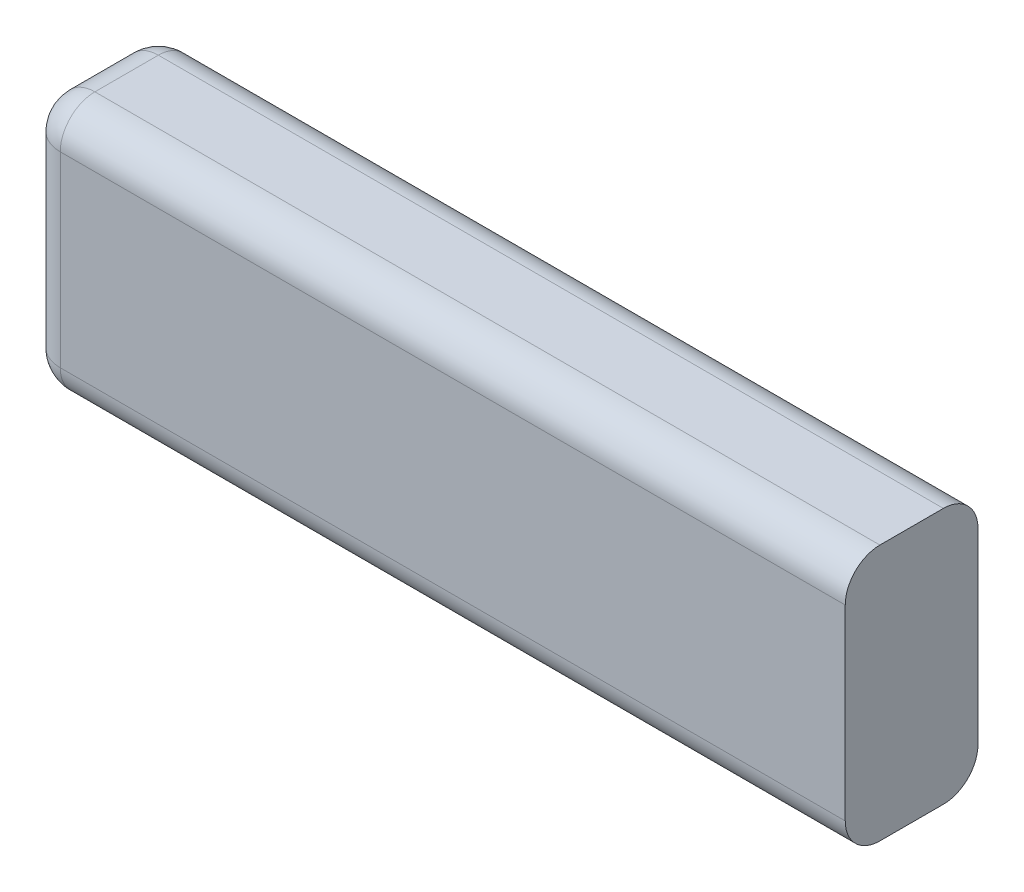
ISO-10303-21;
HEADER;
FILE_DESCRIPTION(('STEP AP214'),'2;1');
FILE_NAME('part.step','',(''),(''),'','','');
FILE_SCHEMA(('AUTOMOTIVE_DESIGN { 1 0 10303 214 1 1 1 1 }'));
ENDSEC;
DATA;
#1=APPLICATION_CONTEXT('core data for automotive mechanical design processes');
#2=APPLICATION_PROTOCOL_DEFINITION('international standard','automotive_design',2000,#1);
#3=PRODUCT_CONTEXT('',#1,'mechanical');
#4=PRODUCT('Part','Part','',(#3));
#5=PRODUCT_RELATED_PRODUCT_CATEGORY('part','',(#4));
#6=PRODUCT_DEFINITION_FORMATION('','',#4);
#7=PRODUCT_DEFINITION_CONTEXT('part definition',#1,'design');
#8=PRODUCT_DEFINITION('design','',#6,#7);
#9=PRODUCT_DEFINITION_SHAPE('','',#8);
#10=(LENGTH_UNIT() NAMED_UNIT(*) SI_UNIT(.MILLI.,.METRE.));
#11=(NAMED_UNIT(*) PLANE_ANGLE_UNIT() SI_UNIT($,.RADIAN.));
#12=(NAMED_UNIT(*) SI_UNIT($,.STERADIAN.) SOLID_ANGLE_UNIT());
#13=UNCERTAINTY_MEASURE_WITH_UNIT(LENGTH_MEASURE(1.E-05),#10,'distance_accuracy_value','');
#14=(GEOMETRIC_REPRESENTATION_CONTEXT(3) GLOBAL_UNCERTAINTY_ASSIGNED_CONTEXT((#13)) GLOBAL_UNIT_ASSIGNED_CONTEXT((#10,
#11,#12)) REPRESENTATION_CONTEXT('',''));
#15=CARTESIAN_POINT('',(0.,0.,0.));
#16=DIRECTION('',(0.,0.,1.));
#17=DIRECTION('',(1.,0.,0.));
#18=AXIS2_PLACEMENT_3D('',#15,#16,#17);
#19=CARTESIAN_POINT('',(0.,0.,5.75));
#20=DIRECTION('',(1.,0.,0.));
#21=DIRECTION('',(0.,0.,-1.));
#22=AXIS2_PLACEMENT_3D('',#19,#20,#21);
#23=PLANE('',#22);
#24=DIRECTION('',(0.,-1.,0.));
#25=VECTOR('',#24,1.);
#26=CARTESIAN_POINT('',(0.,0.,1.5));
#27=LINE('',#26,#25);
#28=CARTESIAN_POINT('',(0.,9.6,1.5));
#29=VERTEX_POINT('',#28);
#30=CARTESIAN_POINT('',(0.,1.5,1.5));
#31=VERTEX_POINT('',#30);
#32=EDGE_CURVE('E159',#29,#31,#27,.T.);
#33=ORIENTED_EDGE('',*,*,#32,.T.);
#34=DIRECTION('',(0.,0.,-1.));
#35=VECTOR('',#34,1.);
#36=CARTESIAN_POINT('',(0.,1.5,5.75));
#37=LINE('',#36,#35);
#38=CARTESIAN_POINT('',(0.,1.5,4.25));
#39=VERTEX_POINT('',#38);
#40=EDGE_CURVE('E161',#31,#39,#37,.F.);
#41=ORIENTED_EDGE('',*,*,#40,.T.);
#42=DIRECTION('',(0.,-1.,0.));
#43=VECTOR('',#42,1.);
#44=CARTESIAN_POINT('',(0.,0.,4.25));
#45=LINE('',#44,#43);
#46=CARTESIAN_POINT('',(0.,9.6,4.25));
#47=VERTEX_POINT('',#46);
#48=EDGE_CURVE('E157',#39,#47,#45,.F.);
#49=ORIENTED_EDGE('',*,*,#48,.T.);
#50=DIRECTION('',(0.,0.,-1.));
#51=VECTOR('',#50,1.);
#52=CARTESIAN_POINT('',(0.,9.6,5.75));
#53=LINE('',#52,#51);
#54=EDGE_CURVE('E155',#47,#29,#53,.T.);
#55=ORIENTED_EDGE('',*,*,#54,.T.);
#56=EDGE_LOOP('',(#33,#41,#49,#55));
#57=FACE_BOUND('',#56,.T.);
#58=ADVANCED_FACE('F32',(#57),#23,.F.);
#59=CARTESIAN_POINT('',(0.,0.,5.75));
#60=DIRECTION('',(0.,1.,0.));
#61=DIRECTION('',(0.,0.,1.));
#62=AXIS2_PLACEMENT_3D('',#59,#60,#61);
#63=PLANE('',#62);
#64=DIRECTION('',(0.,0.,-1.));
#65=VECTOR('',#64,1.);
#66=CARTESIAN_POINT('',(1.5,0.,5.75));
#67=LINE('',#66,#65);
#68=CARTESIAN_POINT('',(1.5,0.,4.25));
#69=VERTEX_POINT('',#68);
#70=CARTESIAN_POINT('',(1.5,0.,1.5));
#71=VERTEX_POINT('',#70);
#72=EDGE_CURVE('E128',#69,#71,#67,.T.);
#73=ORIENTED_EDGE('',*,*,#72,.T.);
#74=DIRECTION('',(1.,0.,0.));
#75=VECTOR('',#74,1.);
#76=CARTESIAN_POINT('',(35.5,0.,1.5));
#77=LINE('',#76,#75);
#78=CARTESIAN_POINT('',(35.5,0.,1.5));
#79=VERTEX_POINT('',#78);
#80=EDGE_CURVE('E127',#71,#79,#77,.T.);
#81=ORIENTED_EDGE('',*,*,#80,.T.);
#82=DIRECTION('',(0.,0.,-1.));
#83=VECTOR('',#82,1.);
#84=CARTESIAN_POINT('',(35.5,0.,5.75));
#85=LINE('',#84,#83);
#86=CARTESIAN_POINT('',(35.5,0.,4.25));
#87=VERTEX_POINT('',#86);
#88=EDGE_CURVE('E112',#87,#79,#85,.T.);
#89=ORIENTED_EDGE('',*,*,#88,.F.);
#90=DIRECTION('',(1.,0.,0.));
#91=VECTOR('',#90,1.);
#92=CARTESIAN_POINT('',(0.,0.,4.25));
#93=LINE('',#92,#91);
#94=EDGE_CURVE('E124',#87,#69,#93,.F.);
#95=ORIENTED_EDGE('',*,*,#94,.T.);
#96=EDGE_LOOP('',(#73,#81,#89,#95));
#97=FACE_BOUND('',#96,.T.);
#98=ADVANCED_FACE('F123',(#97),#63,.F.);
#99=CARTESIAN_POINT('',(35.5,0.,5.75));
#100=DIRECTION('',(-1.,0.,0.));
#101=DIRECTION('',(0.,0.,1.));
#102=AXIS2_PLACEMENT_3D('',#99,#100,#101);
#103=PLANE('',#102);
#104=ORIENTED_EDGE('',*,*,#88,.T.);
#105=CARTESIAN_POINT('',(35.5,1.5,1.5));
#106=DIRECTION('',(-1.,0.,0.));
#107=DIRECTION('',(0.,0.,1.));
#108=AXIS2_PLACEMENT_3D('',#105,#106,#107);
#109=CIRCLE('',#108,1.5);
#110=CARTESIAN_POINT('',(35.5,1.5,0.));
#111=VERTEX_POINT('',#110);
#112=EDGE_CURVE('E118',#79,#111,#109,.F.);
#113=ORIENTED_EDGE('',*,*,#112,.T.);
#114=DIRECTION('',(0.,1.,0.));
#115=VECTOR('',#114,1.);
#116=CARTESIAN_POINT('',(35.5,0.,0.));
#117=LINE('',#116,#115);
#118=CARTESIAN_POINT('',(35.5,9.6,0.));
#119=VERTEX_POINT('',#118);
#120=EDGE_CURVE('E198',#111,#119,#117,.T.);
#121=ORIENTED_EDGE('',*,*,#120,.T.);
#122=CARTESIAN_POINT('',(35.5,9.6,1.5));
#123=DIRECTION('',(-1.,0.,0.));
#124=DIRECTION('',(0.,0.,1.));
#125=AXIS2_PLACEMENT_3D('',#122,#123,#124);
#126=CIRCLE('',#125,1.5);
#127=CARTESIAN_POINT('',(35.5,11.1,1.5));
#128=VERTEX_POINT('',#127);
#129=EDGE_CURVE('E119',#119,#128,#126,.F.);
#130=ORIENTED_EDGE('',*,*,#129,.T.);
#131=DIRECTION('',(0.,0.,-1.));
#132=VECTOR('',#131,1.);
#133=CARTESIAN_POINT('',(35.5,11.1,5.75));
#134=LINE('',#133,#132);
#135=CARTESIAN_POINT('',(35.5,11.1,4.25));
#136=VERTEX_POINT('',#135);
#137=EDGE_CURVE('E129',#136,#128,#134,.T.);
#138=ORIENTED_EDGE('',*,*,#137,.F.);
#139=CARTESIAN_POINT('',(35.5,9.6,4.25));
#140=DIRECTION('',(-1.,0.,0.));
#141=DIRECTION('',(0.,0.,1.));
#142=AXIS2_PLACEMENT_3D('',#139,#140,#141);
#143=CIRCLE('',#142,1.5);
#144=CARTESIAN_POINT('',(35.5,9.6,5.75));
#145=VERTEX_POINT('',#144);
#146=EDGE_CURVE('E136',#136,#145,#143,.F.);
#147=ORIENTED_EDGE('',*,*,#146,.T.);
#148=DIRECTION('',(0.,1.,0.));
#149=VECTOR('',#148,1.);
#150=CARTESIAN_POINT('',(35.5,0.,5.75));
#151=LINE('',#150,#149);
#152=CARTESIAN_POINT('',(35.5,1.5,5.75));
#153=VERTEX_POINT('',#152);
#154=EDGE_CURVE('E114',#153,#145,#151,.T.);
#155=ORIENTED_EDGE('',*,*,#154,.F.);
#156=CARTESIAN_POINT('',(35.5,1.5,4.25));
#157=DIRECTION('',(-1.,0.,0.));
#158=DIRECTION('',(0.,0.,1.));
#159=AXIS2_PLACEMENT_3D('',#156,#157,#158);
#160=CIRCLE('',#159,1.5);
#161=EDGE_CURVE('E109',#153,#87,#160,.F.);
#162=ORIENTED_EDGE('',*,*,#161,.T.);
#163=EDGE_LOOP('',(#104,#113,#121,#130,#138,#147,#155,#162));
#164=FACE_BOUND('',#163,.T.);
#165=ADVANCED_FACE('F111',(#164),#103,.F.);
#166=CARTESIAN_POINT('',(0.,11.1,5.75));
#167=DIRECTION('',(0.,-1.,0.));
#168=DIRECTION('',(0.,0.,-1.));
#169=AXIS2_PLACEMENT_3D('',#166,#167,#168);
#170=PLANE('',#169);
#171=ORIENTED_EDGE('',*,*,#137,.T.);
#172=DIRECTION('',(-1.,0.,0.));
#173=VECTOR('',#172,1.);
#174=CARTESIAN_POINT('',(0.,11.1,1.5));
#175=LINE('',#174,#173);
#176=CARTESIAN_POINT('',(1.5,11.1,1.5));
#177=VERTEX_POINT('',#176);
#178=EDGE_CURVE('E11',#128,#177,#175,.T.);
#179=ORIENTED_EDGE('',*,*,#178,.T.);
#180=DIRECTION('',(0.,0.,-1.));
#181=VECTOR('',#180,1.);
#182=CARTESIAN_POINT('',(1.5,11.1,5.75));
#183=LINE('',#182,#181);
#184=CARTESIAN_POINT('',(1.5,11.1,4.25));
#185=VERTEX_POINT('',#184);
#186=EDGE_CURVE('E48',#177,#185,#183,.F.);
#187=ORIENTED_EDGE('',*,*,#186,.T.);
#188=DIRECTION('',(-1.,0.,0.));
#189=VECTOR('',#188,1.);
#190=CARTESIAN_POINT('',(0.,11.1,4.25));
#191=LINE('',#190,#189);
#192=EDGE_CURVE('E41',#185,#136,#191,.F.);
#193=ORIENTED_EDGE('',*,*,#192,.T.);
#194=EDGE_LOOP('',(#171,#179,#187,#193));
#195=FACE_BOUND('',#194,.T.);
#196=ADVANCED_FACE('F209',(#195),#170,.F.);
#197=CARTESIAN_POINT('',(0.,0.,5.75));
#198=DIRECTION('',(0.,0.,-1.));
#199=DIRECTION('',(-1.,0.,0.));
#200=AXIS2_PLACEMENT_3D('',#197,#198,#199);
#201=PLANE('',#200);
#202=DIRECTION('',(0.,-1.,0.));
#203=VECTOR('',#202,1.);
#204=CARTESIAN_POINT('',(1.5,0.,5.75));
#205=LINE('',#204,#203);
#206=CARTESIAN_POINT('',(1.5,9.6,5.75));
#207=VERTEX_POINT('',#206);
#208=CARTESIAN_POINT('',(1.5,1.5,5.75));
#209=VERTEX_POINT('',#208);
#210=EDGE_CURVE('E151',#207,#209,#205,.T.);
#211=ORIENTED_EDGE('',*,*,#210,.T.);
#212=DIRECTION('',(1.,0.,0.));
#213=VECTOR('',#212,1.);
#214=CARTESIAN_POINT('',(0.,1.5,5.75));
#215=LINE('',#214,#213);
#216=EDGE_CURVE('E153',#209,#153,#215,.T.);
#217=ORIENTED_EDGE('',*,*,#216,.T.);
#218=ORIENTED_EDGE('',*,*,#154,.T.);
#219=DIRECTION('',(-1.,0.,0.));
#220=VECTOR('',#219,1.);
#221=CARTESIAN_POINT('',(0.,9.6,5.75));
#222=LINE('',#221,#220);
#223=EDGE_CURVE('E149',#145,#207,#222,.T.);
#224=ORIENTED_EDGE('',*,*,#223,.T.);
#225=EDGE_LOOP('',(#211,#217,#218,#224));
#226=FACE_BOUND('',#225,.T.);
#227=ADVANCED_FACE('F347',(#226),#201,.F.);
#228=CARTESIAN_POINT('',(0.,0.,0.));
#229=DIRECTION('',(0.,0.,-1.));
#230=DIRECTION('',(-1.,0.,0.));
#231=AXIS2_PLACEMENT_3D('',#228,#229,#230);
#232=PLANE('',#231);
#233=ORIENTED_EDGE('',*,*,#120,.F.);
#234=DIRECTION('',(1.,0.,0.));
#235=VECTOR('',#234,1.);
#236=CARTESIAN_POINT('',(0.,1.5,0.));
#237=LINE('',#236,#235);
#238=CARTESIAN_POINT('',(1.5,1.5,0.));
#239=VERTEX_POINT('',#238);
#240=EDGE_CURVE('E147',#111,#239,#237,.F.);
#241=ORIENTED_EDGE('',*,*,#240,.T.);
#242=DIRECTION('',(0.,-1.,0.));
#243=VECTOR('',#242,1.);
#244=CARTESIAN_POINT('',(1.5,11.1,0.));
#245=LINE('',#244,#243);
#246=CARTESIAN_POINT('',(1.5,9.6,0.));
#247=VERTEX_POINT('',#246);
#248=EDGE_CURVE('E145',#239,#247,#245,.F.);
#249=ORIENTED_EDGE('',*,*,#248,.T.);
#250=DIRECTION('',(-1.,0.,0.));
#251=VECTOR('',#250,1.);
#252=CARTESIAN_POINT('',(35.5,9.6,0.));
#253=LINE('',#252,#251);
#254=EDGE_CURVE('E143',#247,#119,#253,.F.);
#255=ORIENTED_EDGE('',*,*,#254,.T.);
#256=EDGE_LOOP('',(#233,#241,#249,#255));
#257=FACE_BOUND('',#256,.T.);
#258=ADVANCED_FACE('F235',(#257),#232,.T.);
#259=CARTESIAN_POINT('',(0.,9.6,4.25));
#260=DIRECTION('',(-1.,0.,0.));
#261=DIRECTION('',(0.,0.,1.));
#262=AXIS2_PLACEMENT_3D('',#259,#260,#261);
#263=CYLINDRICAL_SURFACE('',#262,1.5);
#264=CARTESIAN_POINT('',(1.5,9.6,4.25));
#265=DIRECTION('',(-1.,0.,0.));
#266=DIRECTION('',(0.,0.,1.));
#267=AXIS2_PLACEMENT_3D('',#264,#265,#266);
#268=CIRCLE('',#267,1.5);
#269=EDGE_CURVE('E36',#207,#185,#268,.T.);
#270=ORIENTED_EDGE('',*,*,#269,.F.);
#271=ORIENTED_EDGE('',*,*,#223,.F.);
#272=ORIENTED_EDGE('',*,*,#146,.F.);
#273=ORIENTED_EDGE('',*,*,#192,.F.);
#274=EDGE_LOOP('',(#270,#271,#272,#273));
#275=FACE_BOUND('',#274,.T.);
#276=ADVANCED_FACE('F34',(#275),#263,.T.);
#277=CARTESIAN_POINT('',(1.5,9.6,4.25));
#278=DIRECTION('',(0.,0.,1.));
#279=DIRECTION('',(1.,0.,0.));
#280=AXIS2_PLACEMENT_3D('',#277,#278,#279);
#281=SPHERICAL_SURFACE('',#280,1.5);
#282=CARTESIAN_POINT('',(1.5,9.6,4.25));
#283=DIRECTION('',(0.,1.,0.));
#284=DIRECTION('',(0.,0.,1.));
#285=AXIS2_PLACEMENT_3D('',#282,#283,#284);
#286=CIRCLE('',#285,1.5);
#287=EDGE_CURVE('E190',#207,#47,#286,.F.);
#288=ORIENTED_EDGE('',*,*,#287,.F.);
#289=ORIENTED_EDGE('',*,*,#269,.T.);
#290=CARTESIAN_POINT('',(1.5,9.6,4.25));
#291=DIRECTION('',(0.,0.,1.));
#292=DIRECTION('',(1.,0.,0.));
#293=AXIS2_PLACEMENT_3D('',#290,#291,#292);
#294=CIRCLE('',#293,1.5);
#295=EDGE_CURVE('E192',#47,#185,#294,.F.);
#296=ORIENTED_EDGE('',*,*,#295,.F.);
#297=EDGE_LOOP('',(#288,#289,#296));
#298=FACE_BOUND('',#297,.T.);
#299=ADVANCED_FACE('F228',(#298),#281,.T.);
#300=CARTESIAN_POINT('',(0.,9.6,1.5));
#301=DIRECTION('',(1.,0.,0.));
#302=DIRECTION('',(0.,0.,-1.));
#303=AXIS2_PLACEMENT_3D('',#300,#301,#302);
#304=CYLINDRICAL_SURFACE('',#303,1.5);
#305=ORIENTED_EDGE('',*,*,#129,.F.);
#306=ORIENTED_EDGE('',*,*,#254,.F.);
#307=CARTESIAN_POINT('',(1.5,9.6,1.5));
#308=DIRECTION('',(-1.,0.,0.));
#309=DIRECTION('',(0.,0.,1.));
#310=AXIS2_PLACEMENT_3D('',#307,#308,#309);
#311=CIRCLE('',#310,1.5);
#312=EDGE_CURVE('E187',#177,#247,#311,.T.);
#313=ORIENTED_EDGE('',*,*,#312,.F.);
#314=ORIENTED_EDGE('',*,*,#178,.F.);
#315=EDGE_LOOP('',(#305,#306,#313,#314));
#316=FACE_BOUND('',#315,.T.);
#317=ADVANCED_FACE('F213',(#316),#304,.T.);
#318=CARTESIAN_POINT('',(1.5,9.6,5.75));
#319=DIRECTION('',(0.,0.,-1.));
#320=DIRECTION('',(-1.,0.,0.));
#321=AXIS2_PLACEMENT_3D('',#318,#319,#320);
#322=CYLINDRICAL_SURFACE('',#321,1.5);
#323=ORIENTED_EDGE('',*,*,#295,.T.);
#324=ORIENTED_EDGE('',*,*,#186,.F.);
#325=CARTESIAN_POINT('',(1.5,9.6,1.5));
#326=DIRECTION('',(0.,0.,-1.));
#327=DIRECTION('',(-1.,0.,0.));
#328=AXIS2_PLACEMENT_3D('',#325,#326,#327);
#329=CIRCLE('',#328,1.5);
#330=EDGE_CURVE('E184',#29,#177,#329,.T.);
#331=ORIENTED_EDGE('',*,*,#330,.F.);
#332=ORIENTED_EDGE('',*,*,#54,.F.);
#333=EDGE_LOOP('',(#323,#324,#331,#332));
#334=FACE_BOUND('',#333,.T.);
#335=ADVANCED_FACE('F220',(#334),#322,.T.);
#336=CARTESIAN_POINT('',(1.5,0.,4.25));
#337=DIRECTION('',(0.,-1.,0.));
#338=DIRECTION('',(0.,0.,-1.));
#339=AXIS2_PLACEMENT_3D('',#336,#337,#338);
#340=CYLINDRICAL_SURFACE('',#339,1.5);
#341=ORIENTED_EDGE('',*,*,#287,.T.);
#342=ORIENTED_EDGE('',*,*,#48,.F.);
#343=CARTESIAN_POINT('',(1.5,1.5,4.25));
#344=DIRECTION('',(0.,-1.,0.));
#345=DIRECTION('',(0.,0.,-1.));
#346=AXIS2_PLACEMENT_3D('',#343,#344,#345);
#347=CIRCLE('',#346,1.5);
#348=EDGE_CURVE('E181',#209,#39,#347,.T.);
#349=ORIENTED_EDGE('',*,*,#348,.F.);
#350=ORIENTED_EDGE('',*,*,#210,.F.);
#351=EDGE_LOOP('',(#341,#342,#349,#350));
#352=FACE_BOUND('',#351,.T.);
#353=ADVANCED_FACE('F227',(#352),#340,.T.);
#354=CARTESIAN_POINT('',(0.,1.5,4.25));
#355=DIRECTION('',(1.,0.,0.));
#356=DIRECTION('',(0.,0.,-1.));
#357=AXIS2_PLACEMENT_3D('',#354,#355,#356);
#358=CYLINDRICAL_SURFACE('',#357,1.5);
#359=ORIENTED_EDGE('',*,*,#161,.F.);
#360=ORIENTED_EDGE('',*,*,#216,.F.);
#361=CARTESIAN_POINT('',(1.5,1.5,4.25));
#362=DIRECTION('',(-1.,0.,0.));
#363=DIRECTION('',(0.,0.,1.));
#364=AXIS2_PLACEMENT_3D('',#361,#362,#363);
#365=CIRCLE('',#364,1.5);
#366=EDGE_CURVE('E133',#69,#209,#365,.T.);
#367=ORIENTED_EDGE('',*,*,#366,.F.);
#368=ORIENTED_EDGE('',*,*,#94,.F.);
#369=EDGE_LOOP('',(#359,#360,#367,#368));
#370=FACE_BOUND('',#369,.T.);
#371=ADVANCED_FACE('F131',(#370),#358,.T.);
#372=CARTESIAN_POINT('',(1.5,9.6,1.5));
#373=DIRECTION('',(0.,0.,1.));
#374=DIRECTION('',(1.,0.,0.));
#375=AXIS2_PLACEMENT_3D('',#372,#373,#374);
#376=SPHERICAL_SURFACE('',#375,1.5);
#377=ORIENTED_EDGE('',*,*,#330,.T.);
#378=ORIENTED_EDGE('',*,*,#312,.T.);
#379=CARTESIAN_POINT('',(1.5,9.6,1.5));
#380=DIRECTION('',(0.,1.,0.));
#381=DIRECTION('',(0.,0.,1.));
#382=AXIS2_PLACEMENT_3D('',#379,#380,#381);
#383=CIRCLE('',#382,1.5);
#384=EDGE_CURVE('E177',#29,#247,#383,.F.);
#385=ORIENTED_EDGE('',*,*,#384,.F.);
#386=EDGE_LOOP('',(#377,#378,#385));
#387=FACE_BOUND('',#386,.T.);
#388=ADVANCED_FACE('F218',(#387),#376,.T.);
#389=CARTESIAN_POINT('',(1.5,1.5,4.25));
#390=DIRECTION('',(0.,0.,1.));
#391=DIRECTION('',(1.,0.,0.));
#392=AXIS2_PLACEMENT_3D('',#389,#390,#391);
#393=SPHERICAL_SURFACE('',#392,1.5);
#394=ORIENTED_EDGE('',*,*,#366,.T.);
#395=ORIENTED_EDGE('',*,*,#348,.T.);
#396=CARTESIAN_POINT('',(1.5,1.5,4.25));
#397=DIRECTION('',(0.,0.,1.));
#398=DIRECTION('',(1.,0.,0.));
#399=AXIS2_PLACEMENT_3D('',#396,#397,#398);
#400=CIRCLE('',#399,1.5);
#401=EDGE_CURVE('E175',#69,#39,#400,.F.);
#402=ORIENTED_EDGE('',*,*,#401,.F.);
#403=EDGE_LOOP('',(#394,#395,#402));
#404=FACE_BOUND('',#403,.T.);
#405=ADVANCED_FACE('F260',(#404),#393,.T.);
#406=CARTESIAN_POINT('',(1.5,0.,1.5));
#407=DIRECTION('',(0.,1.,0.));
#408=DIRECTION('',(0.,0.,1.));
#409=AXIS2_PLACEMENT_3D('',#406,#407,#408);
#410=CYLINDRICAL_SURFACE('',#409,1.5);
#411=ORIENTED_EDGE('',*,*,#384,.T.);
#412=ORIENTED_EDGE('',*,*,#248,.F.);
#413=CARTESIAN_POINT('',(1.5,1.5,1.5));
#414=DIRECTION('',(0.,-1.,0.));
#415=DIRECTION('',(0.,0.,-1.));
#416=AXIS2_PLACEMENT_3D('',#413,#414,#415);
#417=CIRCLE('',#416,1.5);
#418=EDGE_CURVE('E172',#31,#239,#417,.T.);
#419=ORIENTED_EDGE('',*,*,#418,.F.);
#420=ORIENTED_EDGE('',*,*,#32,.F.);
#421=EDGE_LOOP('',(#411,#412,#419,#420));
#422=FACE_BOUND('',#421,.T.);
#423=ADVANCED_FACE('F256',(#422),#410,.T.);
#424=CARTESIAN_POINT('',(1.5,1.5,5.75));
#425=DIRECTION('',(0.,0.,-1.));
#426=DIRECTION('',(-1.,0.,0.));
#427=AXIS2_PLACEMENT_3D('',#424,#425,#426);
#428=CYLINDRICAL_SURFACE('',#427,1.5);
#429=ORIENTED_EDGE('',*,*,#401,.T.);
#430=ORIENTED_EDGE('',*,*,#40,.F.);
#431=CARTESIAN_POINT('',(1.5,1.5,1.5));
#432=DIRECTION('',(0.,0.,-1.));
#433=DIRECTION('',(-1.,0.,0.));
#434=AXIS2_PLACEMENT_3D('',#431,#432,#433);
#435=CIRCLE('',#434,1.5);
#436=EDGE_CURVE('E169',#71,#31,#435,.T.);
#437=ORIENTED_EDGE('',*,*,#436,.F.);
#438=ORIENTED_EDGE('',*,*,#72,.F.);
#439=EDGE_LOOP('',(#429,#430,#437,#438));
#440=FACE_BOUND('',#439,.T.);
#441=ADVANCED_FACE('F252',(#440),#428,.T.);
#442=CARTESIAN_POINT('',(1.5,1.5,1.5));
#443=DIRECTION('',(0.,0.,1.));
#444=DIRECTION('',(1.,0.,0.));
#445=AXIS2_PLACEMENT_3D('',#442,#443,#444);
#446=SPHERICAL_SURFACE('',#445,1.5);
#447=ORIENTED_EDGE('',*,*,#436,.T.);
#448=ORIENTED_EDGE('',*,*,#418,.T.);
#449=CARTESIAN_POINT('',(1.5,1.5,1.5));
#450=DIRECTION('',(-1.,0.,0.));
#451=DIRECTION('',(0.,0.,1.));
#452=AXIS2_PLACEMENT_3D('',#449,#450,#451);
#453=CIRCLE('',#452,1.5);
#454=EDGE_CURVE('E166',#71,#239,#453,.F.);
#455=ORIENTED_EDGE('',*,*,#454,.F.);
#456=EDGE_LOOP('',(#447,#448,#455));
#457=FACE_BOUND('',#456,.T.);
#458=ADVANCED_FACE('F248',(#457),#446,.T.);
#459=CARTESIAN_POINT('',(0.,1.5,1.5));
#460=DIRECTION('',(-1.,0.,0.));
#461=DIRECTION('',(0.,0.,1.));
#462=AXIS2_PLACEMENT_3D('',#459,#460,#461);
#463=CYLINDRICAL_SURFACE('',#462,1.5);
#464=ORIENTED_EDGE('',*,*,#454,.T.);
#465=ORIENTED_EDGE('',*,*,#240,.F.);
#466=ORIENTED_EDGE('',*,*,#112,.F.);
#467=ORIENTED_EDGE('',*,*,#80,.F.);
#468=EDGE_LOOP('',(#464,#465,#466,#467));
#469=FACE_BOUND('',#468,.T.);
#470=ADVANCED_FACE('F245',(#469),#463,.T.);
#471=CLOSED_SHELL('',(#58,#98,#165,#196,#227,#258,#276,#299,#317,#335,#353,#371,#388,#405,#423,
#441,#458,#470));
#472=MANIFOLD_SOLID_BREP('B2',#471);
#473=ADVANCED_BREP_SHAPE_REPRESENTATION('',(#18,#472),#14);
#474=SHAPE_DEFINITION_REPRESENTATION(#9,#473);
ENDSEC;
END-ISO-10303-21;
